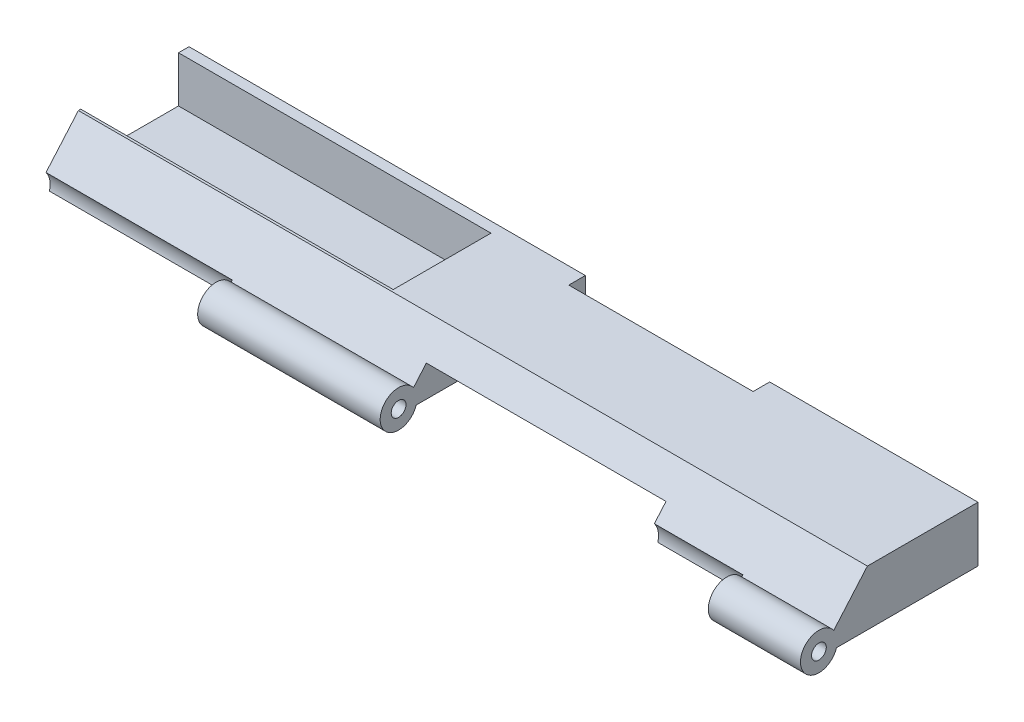
ISO-10303-21;
HEADER;
FILE_DESCRIPTION(('STEP AP214'),'2;1');
FILE_NAME('part.step','',(''),(''),'','','');
FILE_SCHEMA(('AUTOMOTIVE_DESIGN { 1 0 10303 214 1 1 1 1 }'));
ENDSEC;
DATA;
#1=APPLICATION_CONTEXT('core data for automotive mechanical design processes');
#2=APPLICATION_PROTOCOL_DEFINITION('international standard','automotive_design',2000,#1);
#3=PRODUCT_CONTEXT('',#1,'mechanical');
#4=PRODUCT('Part','Part','',(#3));
#5=PRODUCT_RELATED_PRODUCT_CATEGORY('part','',(#4));
#6=PRODUCT_DEFINITION_FORMATION('','',#4);
#7=PRODUCT_DEFINITION_CONTEXT('part definition',#1,'design');
#8=PRODUCT_DEFINITION('design','',#6,#7);
#9=PRODUCT_DEFINITION_SHAPE('','',#8);
#10=(LENGTH_UNIT() NAMED_UNIT(*) SI_UNIT(.MILLI.,.METRE.));
#11=(NAMED_UNIT(*) PLANE_ANGLE_UNIT() SI_UNIT($,.RADIAN.));
#12=(NAMED_UNIT(*) SI_UNIT($,.STERADIAN.) SOLID_ANGLE_UNIT());
#13=UNCERTAINTY_MEASURE_WITH_UNIT(LENGTH_MEASURE(1.E-05),#10,'distance_accuracy_value','');
#14=(GEOMETRIC_REPRESENTATION_CONTEXT(3) GLOBAL_UNCERTAINTY_ASSIGNED_CONTEXT((#13)) GLOBAL_UNIT_ASSIGNED_CONTEXT((#10,
#11,#12)) REPRESENTATION_CONTEXT('',''));
#15=CARTESIAN_POINT('',(0.,0.,0.));
#16=DIRECTION('',(0.,0.,1.));
#17=DIRECTION('',(1.,0.,0.));
#18=AXIS2_PLACEMENT_3D('',#15,#16,#17);
#19=CARTESIAN_POINT('',(-33.0281449270308,49.1077410265045,79.435537181548));
#20=DIRECTION('',(0.,-1.,0.));
#21=DIRECTION('',(1.,0.,0.));
#22=AXIS2_PLACEMENT_3D('',#19,#20,#21);
#23=PLANE('',#22);
#24=DIRECTION('',(0.,0.,1.));
#25=VECTOR('',#24,1.);
#26=CARTESIAN_POINT('',(3.67485507296902,49.1077410265045,79.435537181548));
#27=LINE('',#26,#25);
#28=CARTESIAN_POINT('',(3.67485507296901,49.1077410265045,65.973537181548));
#29=VERTEX_POINT('',#28);
#30=CARTESIAN_POINT('',(3.67485507296901,49.1077410265045,79.435537181548));
#31=VERTEX_POINT('',#30);
#32=EDGE_CURVE('E57',#29,#31,#27,.T.);
#33=ORIENTED_EDGE('',*,*,#32,.F.);
#34=DIRECTION('',(-1.,0.,0.));
#35=VECTOR('',#34,1.);
#36=CARTESIAN_POINT('',(-2.37034492703082,49.1077410265045,65.973537181548));
#37=LINE('',#36,#35);
#38=CARTESIAN_POINT('',(-33.0281449270308,49.1077410265045,65.973537181548));
#39=VERTEX_POINT('',#38);
#40=EDGE_CURVE('E196',#29,#39,#37,.T.);
#41=ORIENTED_EDGE('',*,*,#40,.T.);
#42=DIRECTION('',(0.,0.,-1.));
#43=VECTOR('',#42,1.);
#44=CARTESIAN_POINT('',(-33.0281449270308,49.1077410265045,79.435537181548));
#45=LINE('',#44,#43);
#46=CARTESIAN_POINT('',(-33.0281449270308,49.1077410265045,79.435537181548));
#47=VERTEX_POINT('',#46);
#48=EDGE_CURVE('E307',#47,#39,#45,.T.);
#49=ORIENTED_EDGE('',*,*,#48,.F.);
#50=DIRECTION('',(-1.,0.,0.));
#51=VECTOR('',#50,1.);
#52=CARTESIAN_POINT('',(-33.0281449270308,49.1077410265045,79.435537181548));
#53=LINE('',#52,#51);
#54=EDGE_CURVE('E303',#31,#47,#53,.T.);
#55=ORIENTED_EDGE('',*,*,#54,.F.);
#56=EDGE_LOOP('',(#33,#41,#49,#55));
#57=FACE_BOUND('',#56,.T.);
#58=ADVANCED_FACE('F34',(#57),#23,.F.);
#59=CARTESIAN_POINT('',(-33.0281449270308,50.4743412774687,79.435537181548));
#60=DIRECTION('',(0.,0.,-1.));
#61=DIRECTION('',(-1.,0.,0.));
#62=AXIS2_PLACEMENT_3D('',#59,#60,#61);
#63=PLANE('',#62);
#64=DIRECTION('',(1.,0.,0.));
#65=VECTOR('',#64,1.);
#66=CARTESIAN_POINT('',(-33.0281449270308,55.4577410265045,79.435537181548));
#67=LINE('',#66,#65);
#68=CARTESIAN_POINT('',(-33.0281449270308,55.4577410265045,79.435537181548));
#69=VERTEX_POINT('',#68);
#70=CARTESIAN_POINT('',(10.0248550729692,55.4577410265045,79.435537181548));
#71=VERTEX_POINT('',#70);
#72=EDGE_CURVE('E195',#69,#71,#67,.T.);
#73=ORIENTED_EDGE('',*,*,#72,.T.);
#74=DIRECTION('',(-0.707106781186556,-0.707106781186539,0.));
#75=VECTOR('',#74,1.);
#76=CARTESIAN_POINT('',(-13.9933448015493,31.4395411519867,79.435537181548));
#77=LINE('',#76,#75);
#78=EDGE_CURVE('E50',#71,#31,#77,.T.);
#79=ORIENTED_EDGE('',*,*,#78,.T.);
#80=ORIENTED_EDGE('',*,*,#54,.T.);
#81=DIRECTION('',(0.,1.,0.));
#82=VECTOR('',#81,1.);
#83=CARTESIAN_POINT('',(-33.0281449270308,55.4577410265045,79.435537181548));
#84=LINE('',#83,#82);
#85=EDGE_CURVE('E305',#47,#69,#84,.T.);
#86=ORIENTED_EDGE('',*,*,#85,.T.);
#87=EDGE_LOOP('',(#73,#79,#80,#86));
#88=FACE_BOUND('',#87,.T.);
#89=ADVANCED_FACE('F412',(#88),#63,.T.);
#90=CARTESIAN_POINT('',(-2.37034492703082,55.4577410265045,65.973537181548));
#91=DIRECTION('',(0.,0.,1.));
#92=DIRECTION('',(1.,0.,0.));
#93=AXIS2_PLACEMENT_3D('',#90,#91,#92);
#94=PLANE('',#93);
#95=ORIENTED_EDGE('',*,*,#40,.F.);
#96=DIRECTION('',(0.707106781186556,0.707106781186539,0.));
#97=VECTOR('',#96,1.);
#98=CARTESIAN_POINT('',(3.82725507296902,49.2601410265045,65.973537181548));
#99=LINE('',#98,#97);
#100=CARTESIAN_POINT('',(10.0248550729692,55.4577410265045,65.973537181548));
#101=VERTEX_POINT('',#100);
#102=EDGE_CURVE('E199',#29,#101,#99,.T.);
#103=ORIENTED_EDGE('',*,*,#102,.T.);
#104=DIRECTION('',(-1.,0.,0.));
#105=VECTOR('',#104,1.);
#106=CARTESIAN_POINT('',(-2.37034492703082,55.4577410265045,65.973537181548));
#107=LINE('',#106,#105);
#108=CARTESIAN_POINT('',(-33.0281449270308,55.4577410265045,65.973537181548));
#109=VERTEX_POINT('',#108);
#110=EDGE_CURVE('E184',#101,#109,#107,.T.);
#111=ORIENTED_EDGE('',*,*,#110,.T.);
#112=DIRECTION('',(0.,1.,0.));
#113=VECTOR('',#112,1.);
#114=CARTESIAN_POINT('',(-33.0281449270308,55.4577410265045,65.973537181548));
#115=LINE('',#114,#113);
#116=EDGE_CURVE('E298',#39,#109,#115,.T.);
#117=ORIENTED_EDGE('',*,*,#116,.F.);
#118=EDGE_LOOP('',(#95,#103,#111,#117));
#119=FACE_BOUND('',#118,.T.);
#120=ADVANCED_FACE('F200',(#119),#94,.T.);
#121=CARTESIAN_POINT('',(72.5088550729692,48.5997410265045,86.445937181548));
#122=DIRECTION('',(-1.,0.,0.));
#123=DIRECTION('',(0.,0.,1.));
#124=AXIS2_PLACEMENT_3D('',#121,#122,#123);
#125=CYLINDRICAL_SURFACE('',#124,2.794);
#126=CARTESIAN_POINT('',(62.9838550729692,48.5997410265045,86.445937181548));
#127=DIRECTION('',(1.,0.,0.));
#128=DIRECTION('',(0.,0.,-1.));
#129=AXIS2_PLACEMENT_3D('',#126,#127,#128);
#130=CIRCLE('',#129,2.794);
#131=CARTESIAN_POINT('',(62.9838550729692,50.2990084245781,84.2280719219246));
#132=VERTEX_POINT('',#131);
#133=CARTESIAN_POINT('',(62.9838550729692,47.8377410265045,83.7578538495064));
#134=VERTEX_POINT('',#133);
#135=EDGE_CURVE('E11',#132,#134,#130,.F.);
#136=ORIENTED_EDGE('',*,*,#135,.F.);
#137=DIRECTION('',(-1.,0.,0.));
#138=VECTOR('',#137,1.);
#139=CARTESIAN_POINT('',(72.5088550729692,50.2990084245781,84.2280719219246));
#140=LINE('',#139,#138);
#141=CARTESIAN_POINT('',(50.7918550729692,50.2990084245781,84.2280719219246));
#142=VERTEX_POINT('',#141);
#143=EDGE_CURVE('E283',#142,#132,#140,.F.);
#144=ORIENTED_EDGE('',*,*,#143,.F.);
#145=CARTESIAN_POINT('',(50.7918550729692,48.5997410265045,86.445937181548));
#146=DIRECTION('',(-1.,0.,0.));
#147=DIRECTION('',(0.,0.,1.));
#148=AXIS2_PLACEMENT_3D('',#145,#146,#147);
#149=CIRCLE('',#148,2.794);
#150=CARTESIAN_POINT('',(50.7918550729692,47.8377410265045,83.7578538495064));
#151=VERTEX_POINT('',#150);
#152=EDGE_CURVE('E217',#151,#142,#149,.F.);
#153=ORIENTED_EDGE('',*,*,#152,.F.);
#154=DIRECTION('',(-1.,0.,0.));
#155=VECTOR('',#154,1.);
#156=CARTESIAN_POINT('',(72.5088550729692,47.8377410265045,83.7578538495064));
#157=LINE('',#156,#155);
#158=EDGE_CURVE('E281',#134,#151,#157,.T.);
#159=ORIENTED_EDGE('',*,*,#158,.F.);
#160=EDGE_LOOP('',(#136,#144,#153,#159));
#161=FACE_BOUND('',#160,.T.);
#162=ADVANCED_FACE('F587',(#161),#125,.F.);
#163=CARTESIAN_POINT('',(129.531855072969,44.4241671474557,89.3098449751183));
#164=DIRECTION('',(0.,-0.654213003625094,-0.756310350245078));
#165=DIRECTION('',(0.,0.756310350245078,-0.654213003625094));
#166=AXIS2_PLACEMENT_3D('',#163,#164,#165);
#167=PLANE('',#166);
#168=DIRECTION('',(0.,-0.756310350245078,0.654213003625095));
#169=VECTOR('',#168,1.);
#170=CARTESIAN_POINT('',(-33.0281449270308,44.4241671474557,89.3098449751183));
#171=LINE('',#170,#169);
#172=CARTESIAN_POINT('',(-33.0281449270308,55.4577410265045,79.765737181548));
#173=VERTEX_POINT('',#172);
#174=CARTESIAN_POINT('',(-33.0281449270308,50.2990084245781,84.2280719219246));
#175=VERTEX_POINT('',#174);
#176=EDGE_CURVE('E360',#173,#175,#171,.T.);
#177=ORIENTED_EDGE('',*,*,#176,.T.);
#178=DIRECTION('',(-1.,0.,0.));
#179=VECTOR('',#178,1.);
#180=CARTESIAN_POINT('',(5.19885507296917,50.2990084245781,84.2280719219246));
#181=LINE('',#180,#179);
#182=CARTESIAN_POINT('',(-7.37414492703083,50.2990084245781,84.2280719219246));
#183=VERTEX_POINT('',#182);
#184=EDGE_CURVE('E310',#175,#183,#181,.F.);
#185=ORIENTED_EDGE('',*,*,#184,.T.);
#186=DIRECTION('',(0.,0.756310350245078,-0.654213003625094));
#187=VECTOR('',#186,1.);
#188=CARTESIAN_POINT('',(-7.37414492703083,63.2027515141516,73.0662565085815));
#189=LINE('',#188,#187);
#190=CARTESIAN_POINT('',(-7.37414492703083,50.1024214144257,84.3981208685558));
#191=VERTEX_POINT('',#190);
#192=EDGE_CURVE('E245',#191,#183,#189,.T.);
#193=ORIENTED_EDGE('',*,*,#192,.F.);
#194=DIRECTION('',(-1.,0.,0.));
#195=VECTOR('',#194,1.);
#196=CARTESIAN_POINT('',(-7.88214492703082,50.1024214144257,84.3981208685558));
#197=LINE('',#196,#195);
#198=CARTESIAN_POINT('',(17.7718550729691,50.1024214144257,84.3981208685558));
#199=VERTEX_POINT('',#198);
#200=EDGE_CURVE('E335',#191,#199,#197,.F.);
#201=ORIENTED_EDGE('',*,*,#200,.T.);
#202=DIRECTION('',(0.,0.756310350245078,-0.654213003625094));
#203=VECTOR('',#202,1.);
#204=CARTESIAN_POINT('',(17.7718550729692,44.4241671474557,89.3098449751183));
#205=LINE('',#204,#203);
#206=CARTESIAN_POINT('',(17.7718550729692,52.1557410265045,82.6219870494363));
#207=VERTEX_POINT('',#206);
#208=EDGE_CURVE('E350',#199,#207,#205,.T.);
#209=ORIENTED_EDGE('',*,*,#208,.T.);
#210=DIRECTION('',(1.,0.,0.));
#211=VECTOR('',#210,1.);
#212=CARTESIAN_POINT('',(129.531855072969,52.1557410265045,82.6219870494363));
#213=LINE('',#212,#211);
#214=CARTESIAN_POINT('',(50.7918550729692,52.1557410265045,82.6219870494363));
#215=VERTEX_POINT('',#214);
#216=EDGE_CURVE('E332',#207,#215,#213,.T.);
#217=ORIENTED_EDGE('',*,*,#216,.T.);
#218=DIRECTION('',(0.,0.756310350245078,-0.654213003625094));
#219=VECTOR('',#218,1.);
#220=CARTESIAN_POINT('',(50.7918550729692,63.2027515141517,73.0662565085814));
#221=LINE('',#220,#219);
#222=EDGE_CURVE('E220',#142,#215,#221,.T.);
#223=ORIENTED_EDGE('',*,*,#222,.F.);
#224=ORIENTED_EDGE('',*,*,#143,.T.);
#225=DIRECTION('',(0.,-0.756310350245078,0.654213003625095));
#226=VECTOR('',#225,1.);
#227=CARTESIAN_POINT('',(62.9838550729692,63.2027515141517,73.0662565085814));
#228=LINE('',#227,#226);
#229=CARTESIAN_POINT('',(62.9838550729692,50.1024214144257,84.3981208685558));
#230=VERTEX_POINT('',#229);
#231=EDGE_CURVE('E254',#132,#230,#228,.T.);
#232=ORIENTED_EDGE('',*,*,#231,.T.);
#233=DIRECTION('',(1.,0.,0.));
#234=VECTOR('',#233,1.);
#235=CARTESIAN_POINT('',(85.3358550729692,50.1024214144257,84.3981208685558));
#236=LINE('',#235,#234);
#237=CARTESIAN_POINT('',(75.6838550729692,50.1024214144257,84.3981208685558));
#238=VERTEX_POINT('',#237);
#239=EDGE_CURVE('E289',#230,#238,#236,.T.);
#240=ORIENTED_EDGE('',*,*,#239,.T.);
#241=DIRECTION('',(0.,-0.756310350245078,0.654213003625094));
#242=VECTOR('',#241,1.);
#243=CARTESIAN_POINT('',(75.6838550729692,44.4241671474557,89.3098449751183));
#244=LINE('',#243,#242);
#245=CARTESIAN_POINT('',(75.6838550729692,55.4577410265045,79.765737181548));
#246=VERTEX_POINT('',#245);
#247=EDGE_CURVE('E269',#246,#238,#244,.T.);
#248=ORIENTED_EDGE('',*,*,#247,.F.);
#249=DIRECTION('',(-1.,0.,0.));
#250=VECTOR('',#249,1.);
#251=CARTESIAN_POINT('',(129.531855072969,55.4577410265045,79.765737181548));
#252=LINE('',#251,#250);
#253=EDGE_CURVE('E368',#246,#173,#252,.T.);
#254=ORIENTED_EDGE('',*,*,#253,.T.);
#255=EDGE_LOOP('',(#177,#185,#193,#201,#209,#217,#223,#224,#232,#240,#248,#254));
#256=FACE_BOUND('',#255,.T.);
#257=ADVANCED_FACE('F36',(#256),#167,.F.);
#258=CARTESIAN_POINT('',(129.531855072969,55.4577410265045,96.3042172819337));
#259=DIRECTION('',(0.,-1.,0.));
#260=DIRECTION('',(0.,0.,-1.));
#261=AXIS2_PLACEMENT_3D('',#258,#259,#260);
#262=PLANE('',#261);
#263=DIRECTION('',(-1.,0.,0.));
#264=VECTOR('',#263,1.);
#265=CARTESIAN_POINT('',(129.531855072969,55.4577410265045,64.525737181548));
#266=LINE('',#265,#264);
#267=CARTESIAN_POINT('',(21.5818550729692,55.4577410265045,64.525737181548));
#268=VERTEX_POINT('',#267);
#269=CARTESIAN_POINT('',(-33.0281449270308,55.4577410265045,64.525737181548));
#270=VERTEX_POINT('',#269);
#271=EDGE_CURVE('E370',#268,#270,#266,.T.);
#272=ORIENTED_EDGE('',*,*,#271,.T.);
#273=DIRECTION('',(0.,0.,-1.));
#274=VECTOR('',#273,1.);
#275=CARTESIAN_POINT('',(-33.0281449270308,55.4577410265045,64.525737181548));
#276=LINE('',#275,#274);
#277=EDGE_CURVE('E191',#109,#270,#276,.T.);
#278=ORIENTED_EDGE('',*,*,#277,.F.);
#279=ORIENTED_EDGE('',*,*,#110,.F.);
#280=DIRECTION('',(0.,0.,-1.));
#281=VECTOR('',#280,1.);
#282=CARTESIAN_POINT('',(10.0248550729692,55.4577410265045,65.973537181548));
#283=LINE('',#282,#281);
#284=EDGE_CURVE('E189',#71,#101,#283,.T.);
#285=ORIENTED_EDGE('',*,*,#284,.F.);
#286=ORIENTED_EDGE('',*,*,#72,.F.);
#287=DIRECTION('',(0.,0.,-1.));
#288=VECTOR('',#287,1.);
#289=CARTESIAN_POINT('',(-33.0281449270308,55.4577410265045,64.525737181548));
#290=LINE('',#289,#288);
#291=EDGE_CURVE('E357',#173,#69,#290,.T.);
#292=ORIENTED_EDGE('',*,*,#291,.F.);
#293=ORIENTED_EDGE('',*,*,#253,.F.);
#294=DIRECTION('',(0.,0.,1.));
#295=VECTOR('',#294,1.);
#296=CARTESIAN_POINT('',(75.6838550729692,55.4577410265045,96.3042172819337));
#297=LINE('',#296,#295);
#298=CARTESIAN_POINT('',(75.6838550729692,55.4577410265045,64.525737181548));
#299=VERTEX_POINT('',#298);
#300=EDGE_CURVE('E267',#299,#246,#297,.T.);
#301=ORIENTED_EDGE('',*,*,#300,.F.);
#302=DIRECTION('',(-1.,0.,0.));
#303=VECTOR('',#302,1.);
#304=CARTESIAN_POINT('',(110.481855072969,55.4577410265045,64.525737181548));
#305=LINE('',#304,#303);
#306=CARTESIAN_POINT('',(46.9818550729692,55.4577410265045,64.525737181548));
#307=VERTEX_POINT('',#306);
#308=EDGE_CURVE('E294',#299,#307,#305,.T.);
#309=ORIENTED_EDGE('',*,*,#308,.T.);
#310=DIRECTION('',(0.,0.,-1.));
#311=VECTOR('',#310,1.);
#312=CARTESIAN_POINT('',(46.9818550729692,55.4577410265045,66.811737181548));
#313=LINE('',#312,#311);
#314=CARTESIAN_POINT('',(46.9818550729692,55.4577410265045,66.811737181548));
#315=VERTEX_POINT('',#314);
#316=EDGE_CURVE('E224',#315,#307,#313,.T.);
#317=ORIENTED_EDGE('',*,*,#316,.F.);
#318=DIRECTION('',(-1.,0.,0.));
#319=VECTOR('',#318,1.);
#320=CARTESIAN_POINT('',(129.531855072969,55.4577410265045,66.811737181548));
#321=LINE('',#320,#319);
#322=CARTESIAN_POINT('',(21.5818550729692,55.4577410265045,66.811737181548));
#323=VERTEX_POINT('',#322);
#324=EDGE_CURVE('E343',#315,#323,#321,.T.);
#325=ORIENTED_EDGE('',*,*,#324,.T.);
#326=DIRECTION('',(0.,0.,-1.));
#327=VECTOR('',#326,1.);
#328=CARTESIAN_POINT('',(21.5818550729692,55.4577410265045,96.3042172819337));
#329=LINE('',#328,#327);
#330=EDGE_CURVE('E347',#323,#268,#329,.T.);
#331=ORIENTED_EDGE('',*,*,#330,.T.);
#332=EDGE_LOOP('',(#272,#278,#279,#285,#286,#292,#293,#301,#309,#317,#325,#331));
#333=FACE_BOUND('',#332,.T.);
#334=ADVANCED_FACE('F186',(#333),#262,.F.);
#335=CARTESIAN_POINT('',(110.481855072969,48.5997410265045,86.445937181548));
#336=DIRECTION('',(-1.,0.,0.));
#337=DIRECTION('',(0.,0.,1.));
#338=AXIS2_PLACEMENT_3D('',#335,#336,#337);
#339=CYLINDRICAL_SURFACE('',#338,1.016);
#340=CARTESIAN_POINT('',(75.6838550729692,48.5997410265045,86.445937181548));
#341=DIRECTION('',(1.,0.,0.));
#342=DIRECTION('',(0.,0.,-1.));
#343=AXIS2_PLACEMENT_3D('',#340,#341,#342);
#344=CIRCLE('',#343,1.016);
#345=CARTESIAN_POINT('',(75.6838550729692,48.5997410265045,85.429937181548));
#346=VERTEX_POINT('',#345);
#347=EDGE_CURVE('E278',#346,#346,#344,.F.);
#348=ORIENTED_EDGE('',*,*,#347,.F.);
#349=EDGE_LOOP('',(#348));
#350=FACE_BOUND('',#349,.T.);
#351=CARTESIAN_POINT('',(62.9838550729692,48.5997410265045,86.445937181548));
#352=DIRECTION('',(1.,0.,0.));
#353=DIRECTION('',(0.,0.,-1.));
#354=AXIS2_PLACEMENT_3D('',#351,#352,#353);
#355=CIRCLE('',#354,1.016);
#356=CARTESIAN_POINT('',(62.9838550729692,48.5997410265045,85.429937181548));
#357=VERTEX_POINT('',#356);
#358=EDGE_CURVE('E263',#357,#357,#355,.F.);
#359=ORIENTED_EDGE('',*,*,#358,.T.);
#360=EDGE_LOOP('',(#359));
#361=FACE_BOUND('',#360,.T.);
#362=ADVANCED_FACE('F460',(#350,#361),#339,.F.);
#363=CARTESIAN_POINT('',(85.3358550729692,48.5997410265045,86.445937181548));
#364=DIRECTION('',(1.,0.,0.));
#365=DIRECTION('',(0.,0.,-1.));
#366=AXIS2_PLACEMENT_3D('',#363,#364,#365);
#367=CYLINDRICAL_SURFACE('',#366,2.54);
#368=DIRECTION('',(1.,0.,0.));
#369=VECTOR('',#368,1.);
#370=CARTESIAN_POINT('',(85.3358550729692,47.8377410265045,84.022931609949));
#371=LINE('',#370,#369);
#372=CARTESIAN_POINT('',(75.6838550729692,47.8377410265045,84.022931609949));
#373=VERTEX_POINT('',#372);
#374=CARTESIAN_POINT('',(62.9838550729692,47.8377410265045,84.022931609949));
#375=VERTEX_POINT('',#374);
#376=EDGE_CURVE('E292',#373,#375,#371,.F.);
#377=ORIENTED_EDGE('',*,*,#376,.F.);
#378=CARTESIAN_POINT('',(75.6838550729692,48.5997410265045,86.445937181548));
#379=DIRECTION('',(1.,0.,0.));
#380=DIRECTION('',(0.,0.,-1.));
#381=AXIS2_PLACEMENT_3D('',#378,#379,#380);
#382=CIRCLE('',#381,2.54);
#383=EDGE_CURVE('E270',#373,#238,#382,.F.);
#384=ORIENTED_EDGE('',*,*,#383,.T.);
#385=ORIENTED_EDGE('',*,*,#239,.F.);
#386=CARTESIAN_POINT('',(62.9838550729692,48.5997410265045,86.445937181548));
#387=DIRECTION('',(1.,0.,0.));
#388=DIRECTION('',(0.,0.,-1.));
#389=AXIS2_PLACEMENT_3D('',#386,#387,#388);
#390=CIRCLE('',#389,2.54);
#391=EDGE_CURVE('E257',#230,#375,#390,.T.);
#392=ORIENTED_EDGE('',*,*,#391,.T.);
#393=EDGE_LOOP('',(#377,#384,#385,#392));
#394=FACE_BOUND('',#393,.T.);
#395=ADVANCED_FACE('F609',(#394),#367,.T.);
#396=CARTESIAN_POINT('',(110.481855072969,47.8377410265045,96.3042172819337));
#397=DIRECTION('',(0.,1.,0.));
#398=DIRECTION('',(0.,0.,1.));
#399=AXIS2_PLACEMENT_3D('',#396,#397,#398);
#400=PLANE('',#399);
#401=DIRECTION('',(-1.,0.,0.));
#402=VECTOR('',#401,1.);
#403=CARTESIAN_POINT('',(110.481855072969,47.8377410265045,64.525737181548));
#404=LINE('',#403,#402);
#405=CARTESIAN_POINT('',(75.6838550729692,47.8377410265045,64.525737181548));
#406=VERTEX_POINT('',#405);
#407=CARTESIAN_POINT('',(50.7918550729692,47.8377410265045,64.525737181548));
#408=VERTEX_POINT('',#407);
#409=EDGE_CURVE('E296',#406,#408,#404,.T.);
#410=ORIENTED_EDGE('',*,*,#409,.F.);
#411=DIRECTION('',(0.,0.,-1.));
#412=VECTOR('',#411,1.);
#413=CARTESIAN_POINT('',(75.6838550729692,47.8377410265045,96.3042172819337));
#414=LINE('',#413,#412);
#415=EDGE_CURVE('E273',#373,#406,#414,.T.);
#416=ORIENTED_EDGE('',*,*,#415,.F.);
#417=ORIENTED_EDGE('',*,*,#376,.T.);
#418=DIRECTION('',(0.,0.,-1.));
#419=VECTOR('',#418,1.);
#420=CARTESIAN_POINT('',(62.9838550729692,47.8377410265045,0.));
#421=LINE('',#420,#419);
#422=EDGE_CURVE('E260',#375,#134,#421,.T.);
#423=ORIENTED_EDGE('',*,*,#422,.T.);
#424=ORIENTED_EDGE('',*,*,#158,.T.);
#425=DIRECTION('',(0.,0.,1.));
#426=VECTOR('',#425,1.);
#427=CARTESIAN_POINT('',(50.7918550729692,47.8377410265045,0.));
#428=LINE('',#427,#426);
#429=EDGE_CURVE('E214',#408,#151,#428,.T.);
#430=ORIENTED_EDGE('',*,*,#429,.F.);
#431=EDGE_LOOP('',(#410,#416,#417,#423,#424,#430));
#432=FACE_BOUND('',#431,.T.);
#433=ADVANCED_FACE('F616',(#432),#400,.F.);
#434=CARTESIAN_POINT('',(110.481855072969,50.4743412774687,64.525737181548));
#435=DIRECTION('',(0.,0.,1.));
#436=DIRECTION('',(1.,0.,0.));
#437=AXIS2_PLACEMENT_3D('',#434,#435,#436);
#438=PLANE('',#437);
#439=DIRECTION('',(0.,1.,0.));
#440=VECTOR('',#439,1.);
#441=CARTESIAN_POINT('',(75.6838550729692,50.4743412774687,64.525737181548));
#442=LINE('',#441,#440);
#443=EDGE_CURVE('E266',#406,#299,#442,.T.);
#444=ORIENTED_EDGE('',*,*,#443,.F.);
#445=ORIENTED_EDGE('',*,*,#409,.T.);
#446=DIRECTION('',(0.,-1.,0.));
#447=VECTOR('',#446,1.);
#448=CARTESIAN_POINT('',(50.7918550729692,0.,64.525737181548));
#449=LINE('',#448,#447);
#450=CARTESIAN_POINT('',(50.7918550729692,52.1557410265045,64.525737181548));
#451=VERTEX_POINT('',#450);
#452=EDGE_CURVE('E211',#451,#408,#449,.T.);
#453=ORIENTED_EDGE('',*,*,#452,.F.);
#454=DIRECTION('',(1.,0.,0.));
#455=VECTOR('',#454,1.);
#456=CARTESIAN_POINT('',(59.6818550729692,52.1557410265045,64.525737181548));
#457=LINE('',#456,#455);
#458=CARTESIAN_POINT('',(46.9818550729692,52.1557410265045,64.525737181548));
#459=VERTEX_POINT('',#458);
#460=EDGE_CURVE('E286',#459,#451,#457,.T.);
#461=ORIENTED_EDGE('',*,*,#460,.F.);
#462=DIRECTION('',(0.,-1.,0.));
#463=VECTOR('',#462,1.);
#464=CARTESIAN_POINT('',(46.9818550729692,55.4577410265045,64.525737181548));
#465=LINE('',#464,#463);
#466=EDGE_CURVE('E227',#307,#459,#465,.T.);
#467=ORIENTED_EDGE('',*,*,#466,.F.);
#468=ORIENTED_EDGE('',*,*,#308,.F.);
#469=EDGE_LOOP('',(#444,#445,#453,#461,#467,#468));
#470=FACE_BOUND('',#469,.T.);
#471=ADVANCED_FACE('F443',(#470),#438,.F.);
#472=CARTESIAN_POINT('',(-33.0281449270308,52.1557410265045,96.3042172819337));
#473=DIRECTION('',(0.,1.,0.));
#474=DIRECTION('',(0.,0.,1.));
#475=AXIS2_PLACEMENT_3D('',#472,#473,#474);
#476=PLANE('',#475);
#477=ORIENTED_EDGE('',*,*,#460,.T.);
#478=DIRECTION('',(0.,0.,-1.));
#479=VECTOR('',#478,1.);
#480=CARTESIAN_POINT('',(50.7918550729692,52.1557410265045,0.));
#481=LINE('',#480,#479);
#482=EDGE_CURVE('E222',#215,#451,#481,.T.);
#483=ORIENTED_EDGE('',*,*,#482,.F.);
#484=ORIENTED_EDGE('',*,*,#216,.F.);
#485=DIRECTION('',(0.,0.,-1.));
#486=VECTOR('',#485,1.);
#487=CARTESIAN_POINT('',(17.7718550729692,52.1557410265045,64.525737181548));
#488=LINE('',#487,#486);
#489=CARTESIAN_POINT('',(17.7718550729692,52.1557410265045,64.525737181548));
#490=VERTEX_POINT('',#489);
#491=EDGE_CURVE('E326',#207,#490,#488,.T.);
#492=ORIENTED_EDGE('',*,*,#491,.T.);
#493=DIRECTION('',(1.,0.,0.));
#494=VECTOR('',#493,1.);
#495=CARTESIAN_POINT('',(78.7318550729692,52.1557410265045,64.525737181548));
#496=LINE('',#495,#494);
#497=CARTESIAN_POINT('',(21.5818550729692,52.1557410265045,64.525737181548));
#498=VERTEX_POINT('',#497);
#499=EDGE_CURVE('E324',#490,#498,#496,.T.);
#500=ORIENTED_EDGE('',*,*,#499,.T.);
#501=DIRECTION('',(0.,0.,-1.));
#502=VECTOR('',#501,1.);
#503=CARTESIAN_POINT('',(21.5818550729692,52.1557410265045,96.3042172819337));
#504=LINE('',#503,#502);
#505=CARTESIAN_POINT('',(21.5818550729692,52.1557410265045,66.811737181548));
#506=VERTEX_POINT('',#505);
#507=EDGE_CURVE('E329',#506,#498,#504,.T.);
#508=ORIENTED_EDGE('',*,*,#507,.F.);
#509=DIRECTION('',(-1.,0.,0.));
#510=VECTOR('',#509,1.);
#511=CARTESIAN_POINT('',(-33.0281449270308,52.1557410265045,66.811737181548));
#512=LINE('',#511,#510);
#513=CARTESIAN_POINT('',(46.9818550729692,52.1557410265045,66.811737181548));
#514=VERTEX_POINT('',#513);
#515=EDGE_CURVE('E375',#514,#506,#512,.T.);
#516=ORIENTED_EDGE('',*,*,#515,.F.);
#517=DIRECTION('',(0.,0.,1.));
#518=VECTOR('',#517,1.);
#519=CARTESIAN_POINT('',(46.9818550729692,52.1557410265045,64.525737181548));
#520=LINE('',#519,#518);
#521=EDGE_CURVE('E230',#459,#514,#520,.T.);
#522=ORIENTED_EDGE('',*,*,#521,.F.);
#523=EDGE_LOOP('',(#477,#483,#484,#492,#500,#508,#516,#522));
#524=FACE_BOUND('',#523,.T.);
#525=ADVANCED_FACE('F440',(#524),#476,.F.);
#526=CARTESIAN_POINT('',(-33.0281449270308,66.1257410265045,66.811737181548));
#527=DIRECTION('',(0.,0.,1.));
#528=DIRECTION('',(1.,0.,0.));
#529=AXIS2_PLACEMENT_3D('',#526,#527,#528);
#530=PLANE('',#529);
#531=ORIENTED_EDGE('',*,*,#324,.F.);
#532=DIRECTION('',(0.,1.,0.));
#533=VECTOR('',#532,1.);
#534=CARTESIAN_POINT('',(46.9818550729692,52.1557410265045,66.811737181548));
#535=LINE('',#534,#533);
#536=EDGE_CURVE('E233',#514,#315,#535,.T.);
#537=ORIENTED_EDGE('',*,*,#536,.F.);
#538=ORIENTED_EDGE('',*,*,#515,.T.);
#539=DIRECTION('',(0.,-1.,0.));
#540=VECTOR('',#539,1.);
#541=CARTESIAN_POINT('',(21.5818550729692,66.1257410265045,66.811737181548));
#542=LINE('',#541,#540);
#543=EDGE_CURVE('E339',#323,#506,#542,.T.);
#544=ORIENTED_EDGE('',*,*,#543,.F.);
#545=EDGE_LOOP('',(#531,#537,#538,#544));
#546=FACE_BOUND('',#545,.T.);
#547=ADVANCED_FACE('F425',(#546),#530,.F.);
#548=CARTESIAN_POINT('',(5.19885507296917,48.5997410265045,86.445937181548));
#549=DIRECTION('',(-1.,0.,0.));
#550=DIRECTION('',(0.,0.,1.));
#551=AXIS2_PLACEMENT_3D('',#548,#549,#550);
#552=CYLINDRICAL_SURFACE('',#551,2.794);
#553=CARTESIAN_POINT('',(-33.0281449270308,48.5997410265045,86.445937181548));
#554=DIRECTION('',(-1.,0.,0.));
#555=DIRECTION('',(0.,0.,1.));
#556=AXIS2_PLACEMENT_3D('',#553,#554,#555);
#557=CIRCLE('',#556,2.79400000000001);
#558=CARTESIAN_POINT('',(-33.0281449270308,47.8377410265045,83.7578538495064));
#559=VERTEX_POINT('',#558);
#560=EDGE_CURVE('E236',#175,#559,#557,.T.);
#561=ORIENTED_EDGE('',*,*,#560,.T.);
#562=DIRECTION('',(-1.,0.,0.));
#563=VECTOR('',#562,1.);
#564=CARTESIAN_POINT('',(5.19885507296917,47.8377410265045,83.7578538495064));
#565=LINE('',#564,#563);
#566=CARTESIAN_POINT('',(-7.37414492703084,47.8377410265045,83.7578538495064));
#567=VERTEX_POINT('',#566);
#568=EDGE_CURVE('E43',#567,#559,#565,.T.);
#569=ORIENTED_EDGE('',*,*,#568,.F.);
#570=CARTESIAN_POINT('',(-7.37414492703083,48.5997410265045,86.445937181548));
#571=DIRECTION('',(-1.,0.,0.));
#572=DIRECTION('',(0.,0.,1.));
#573=AXIS2_PLACEMENT_3D('',#570,#571,#572);
#574=CIRCLE('',#573,2.794);
#575=EDGE_CURVE('E251',#567,#183,#574,.F.);
#576=ORIENTED_EDGE('',*,*,#575,.T.);
#577=ORIENTED_EDGE('',*,*,#184,.F.);
#578=EDGE_LOOP('',(#561,#569,#576,#577));
#579=FACE_BOUND('',#578,.T.);
#580=ADVANCED_FACE('F385',(#579),#552,.F.);
#581=CARTESIAN_POINT('',(129.531855072969,47.8377410265045,96.3042172819337));
#582=DIRECTION('',(0.,1.,0.));
#583=DIRECTION('',(0.,0.,1.));
#584=AXIS2_PLACEMENT_3D('',#581,#582,#583);
#585=PLANE('',#584);
#586=ORIENTED_EDGE('',*,*,#568,.T.);
#587=DIRECTION('',(0.,0.,-1.));
#588=VECTOR('',#587,1.);
#589=CARTESIAN_POINT('',(-33.0281449270308,47.8377410265045,96.3042172819337));
#590=LINE('',#589,#588);
#591=CARTESIAN_POINT('',(-33.0281449270308,47.8377410265045,64.525737181548));
#592=VERTEX_POINT('',#591);
#593=EDGE_CURVE('E363',#559,#592,#590,.T.);
#594=ORIENTED_EDGE('',*,*,#593,.T.);
#595=DIRECTION('',(-1.,0.,0.));
#596=VECTOR('',#595,1.);
#597=CARTESIAN_POINT('',(129.531855072969,47.8377410265045,64.525737181548));
#598=LINE('',#597,#596);
#599=CARTESIAN_POINT('',(17.7718550729692,47.8377410265045,64.525737181548));
#600=VERTEX_POINT('',#599);
#601=EDGE_CURVE('E372',#600,#592,#598,.T.);
#602=ORIENTED_EDGE('',*,*,#601,.F.);
#603=DIRECTION('',(0.,0.,-1.));
#604=VECTOR('',#603,1.);
#605=CARTESIAN_POINT('',(17.7718550729692,47.8377410265045,82.305737181548));
#606=LINE('',#605,#604);
#607=CARTESIAN_POINT('',(17.7718550729691,47.8377410265045,84.022931609949));
#608=VERTEX_POINT('',#607);
#609=EDGE_CURVE('E355',#608,#600,#606,.T.);
#610=ORIENTED_EDGE('',*,*,#609,.F.);
#611=DIRECTION('',(-1.,0.,0.));
#612=VECTOR('',#611,1.);
#613=CARTESIAN_POINT('',(-7.88214492703082,47.8377410265045,84.022931609949));
#614=LINE('',#613,#612);
#615=CARTESIAN_POINT('',(-7.37414492703083,47.8377410265045,84.022931609949));
#616=VERTEX_POINT('',#615);
#617=EDGE_CURVE('E337',#608,#616,#614,.T.);
#618=ORIENTED_EDGE('',*,*,#617,.T.);
#619=DIRECTION('',(0.,0.,1.));
#620=VECTOR('',#619,1.);
#621=CARTESIAN_POINT('',(-7.37414492703083,47.8377410265045,0.));
#622=LINE('',#621,#620);
#623=EDGE_CURVE('E248',#567,#616,#622,.T.);
#624=ORIENTED_EDGE('',*,*,#623,.F.);
#625=EDGE_LOOP('',(#586,#594,#602,#610,#618,#624));
#626=FACE_BOUND('',#625,.T.);
#627=ADVANCED_FACE('F379',(#626),#585,.F.);
#628=CARTESIAN_POINT('',(-7.88214492703082,48.5997410265045,86.445937181548));
#629=DIRECTION('',(-1.,0.,0.));
#630=DIRECTION('',(0.,0.,1.));
#631=AXIS2_PLACEMENT_3D('',#628,#629,#630);
#632=CYLINDRICAL_SURFACE('',#631,2.54);
#633=ORIENTED_EDGE('',*,*,#200,.F.);
#634=CARTESIAN_POINT('',(-7.37414492703083,48.5997410265045,86.445937181548));
#635=DIRECTION('',(-1.,0.,0.));
#636=DIRECTION('',(0.,0.,1.));
#637=AXIS2_PLACEMENT_3D('',#634,#635,#636);
#638=CIRCLE('',#637,2.54);
#639=EDGE_CURVE('E242',#616,#191,#638,.T.);
#640=ORIENTED_EDGE('',*,*,#639,.F.);
#641=ORIENTED_EDGE('',*,*,#617,.F.);
#642=CARTESIAN_POINT('',(17.7718550729691,48.5997410265045,86.445937181548));
#643=DIRECTION('',(1.,0.,0.));
#644=DIRECTION('',(0.,0.,-1.));
#645=AXIS2_PLACEMENT_3D('',#642,#643,#644);
#646=CIRCLE('',#645,2.54);
#647=EDGE_CURVE('E312',#199,#608,#646,.T.);
#648=ORIENTED_EDGE('',*,*,#647,.F.);
#649=EDGE_LOOP('',(#633,#640,#641,#648));
#650=FACE_BOUND('',#649,.T.);
#651=ADVANCED_FACE('F402',(#650),#632,.T.);
#652=CARTESIAN_POINT('',(129.531855072969,48.5997410265045,86.445937181548));
#653=DIRECTION('',(-1.,0.,0.));
#654=DIRECTION('',(0.,0.,1.));
#655=AXIS2_PLACEMENT_3D('',#652,#653,#654);
#656=CYLINDRICAL_SURFACE('',#655,1.016);
#657=CARTESIAN_POINT('',(17.7718550729691,48.5997410265045,86.445937181548));
#658=DIRECTION('',(1.,0.,0.));
#659=DIRECTION('',(0.,0.,-1.));
#660=AXIS2_PLACEMENT_3D('',#657,#658,#659);
#661=CIRCLE('',#660,1.016);
#662=CARTESIAN_POINT('',(17.7718550729691,48.5997410265045,85.429937181548));
#663=VERTEX_POINT('',#662);
#664=EDGE_CURVE('E315',#663,#663,#661,.F.);
#665=ORIENTED_EDGE('',*,*,#664,.F.);
#666=EDGE_LOOP('',(#665));
#667=FACE_BOUND('',#666,.T.);
#668=CARTESIAN_POINT('',(-7.37414492703083,48.5997410265045,86.445937181548));
#669=DIRECTION('',(-1.,0.,0.));
#670=DIRECTION('',(0.,0.,1.));
#671=AXIS2_PLACEMENT_3D('',#668,#669,#670);
#672=CIRCLE('',#671,1.016);
#673=CARTESIAN_POINT('',(-7.37414492703083,48.5997410265045,87.461937181548));
#674=VERTEX_POINT('',#673);
#675=EDGE_CURVE('E239',#674,#674,#672,.T.);
#676=ORIENTED_EDGE('',*,*,#675,.T.);
#677=EDGE_LOOP('',(#676));
#678=FACE_BOUND('',#677,.T.);
#679=ADVANCED_FACE('F426',(#667,#678),#656,.F.);
#680=CARTESIAN_POINT('',(129.531855072969,50.4743412774687,64.525737181548));
#681=DIRECTION('',(0.,0.,1.));
#682=DIRECTION('',(1.,0.,0.));
#683=AXIS2_PLACEMENT_3D('',#680,#681,#682);
#684=PLANE('',#683);
#685=DIRECTION('',(0.,1.,0.));
#686=VECTOR('',#685,1.);
#687=CARTESIAN_POINT('',(-33.0281449270308,50.4743412774687,64.525737181548));
#688=LINE('',#687,#686);
#689=EDGE_CURVE('E365',#592,#270,#688,.T.);
#690=ORIENTED_EDGE('',*,*,#689,.T.);
#691=ORIENTED_EDGE('',*,*,#271,.F.);
#692=DIRECTION('',(0.,-1.,0.));
#693=VECTOR('',#692,1.);
#694=CARTESIAN_POINT('',(21.5818550729692,66.1257410265045,64.525737181548));
#695=LINE('',#694,#693);
#696=EDGE_CURVE('E340',#268,#498,#695,.T.);
#697=ORIENTED_EDGE('',*,*,#696,.T.);
#698=ORIENTED_EDGE('',*,*,#499,.F.);
#699=DIRECTION('',(0.,-1.,0.));
#700=VECTOR('',#699,1.);
#701=CARTESIAN_POINT('',(17.7718550729692,50.8857410265045,64.525737181548));
#702=LINE('',#701,#700);
#703=EDGE_CURVE('E352',#490,#600,#702,.T.);
#704=ORIENTED_EDGE('',*,*,#703,.T.);
#705=ORIENTED_EDGE('',*,*,#601,.T.);
#706=EDGE_LOOP('',(#690,#691,#697,#698,#704,#705));
#707=FACE_BOUND('',#706,.T.);
#708=ADVANCED_FACE('F392',(#707),#684,.F.);
#709=CARTESIAN_POINT('',(-33.0281449270308,50.4743412774687,96.3042172819337));
#710=DIRECTION('',(1.,0.,0.));
#711=DIRECTION('',(0.,0.,-1.));
#712=AXIS2_PLACEMENT_3D('',#709,#710,#711);
#713=PLANE('',#712);
#714=ORIENTED_EDGE('',*,*,#593,.F.);
#715=ORIENTED_EDGE('',*,*,#560,.F.);
#716=ORIENTED_EDGE('',*,*,#176,.F.);
#717=ORIENTED_EDGE('',*,*,#291,.T.);
#718=ORIENTED_EDGE('',*,*,#85,.F.);
#719=ORIENTED_EDGE('',*,*,#48,.T.);
#720=ORIENTED_EDGE('',*,*,#116,.T.);
#721=ORIENTED_EDGE('',*,*,#277,.T.);
#722=ORIENTED_EDGE('',*,*,#689,.F.);
#723=EDGE_LOOP('',(#714,#715,#716,#717,#718,#719,#720,#721,#722));
#724=FACE_BOUND('',#723,.T.);
#725=ADVANCED_FACE('F389',(#724),#713,.F.);
#726=CARTESIAN_POINT('',(17.7718550729692,50.8857410265045,82.305737181548));
#727=DIRECTION('',(-1.,0.,0.));
#728=DIRECTION('',(0.,0.,1.));
#729=AXIS2_PLACEMENT_3D('',#726,#727,#728);
#730=PLANE('',#729);
#731=CARTESIAN_POINT('',(17.7718550729692,49.9967410265045,67.065737181548));
#732=DIRECTION('',(-1.,0.,0.));
#733=DIRECTION('',(0.,0.,1.));
#734=AXIS2_PLACEMENT_3D('',#731,#732,#733);
#735=CIRCLE('',#734,1.016);
#736=CARTESIAN_POINT('',(17.7718550729692,49.9967410265045,68.081737181548));
#737=VERTEX_POINT('',#736);
#738=EDGE_CURVE('E321',#737,#737,#735,.F.);
#739=ORIENTED_EDGE('',*,*,#738,.F.);
#740=EDGE_LOOP('',(#739));
#741=FACE_BOUND('',#740,.T.);
#742=ORIENTED_EDGE('',*,*,#491,.F.);
#743=ORIENTED_EDGE('',*,*,#208,.F.);
#744=ORIENTED_EDGE('',*,*,#647,.T.);
#745=ORIENTED_EDGE('',*,*,#609,.T.);
#746=ORIENTED_EDGE('',*,*,#703,.F.);
#747=EDGE_LOOP('',(#742,#743,#744,#745,#746));
#748=FACE_BOUND('',#747,.T.);
#749=ORIENTED_EDGE('',*,*,#664,.T.);
#750=EDGE_LOOP('',(#749));
#751=FACE_BOUND('',#750,.T.);
#752=ADVANCED_FACE('F399',(#741,#748,#751),#730,.F.);
#753=CARTESIAN_POINT('',(21.5818550729692,66.1257410265045,96.3042172819337));
#754=DIRECTION('',(-1.,0.,0.));
#755=DIRECTION('',(0.,0.,1.));
#756=AXIS2_PLACEMENT_3D('',#753,#754,#755);
#757=PLANE('',#756);
#758=ORIENTED_EDGE('',*,*,#543,.T.);
#759=ORIENTED_EDGE('',*,*,#507,.T.);
#760=ORIENTED_EDGE('',*,*,#696,.F.);
#761=ORIENTED_EDGE('',*,*,#330,.F.);
#762=EDGE_LOOP('',(#758,#759,#760,#761));
#763=FACE_BOUND('',#762,.T.);
#764=ADVANCED_FACE('F438',(#763),#757,.F.);
#765=CARTESIAN_POINT('',(83.8118550729692,49.9967410265045,67.065737181548));
#766=DIRECTION('',(-1.,0.,0.));
#767=DIRECTION('',(0.,0.,1.));
#768=AXIS2_PLACEMENT_3D('',#765,#766,#767);
#769=CYLINDRICAL_SURFACE('',#768,1.016);
#770=CARTESIAN_POINT('',(12.6918550729692,49.9967410265045,67.065737181548));
#771=DIRECTION('',(1.,0.,0.));
#772=DIRECTION('',(0.,0.,-1.));
#773=AXIS2_PLACEMENT_3D('',#770,#771,#772);
#774=CIRCLE('',#773,1.016);
#775=CARTESIAN_POINT('',(12.6918550729692,49.9967410265045,66.049737181548));
#776=VERTEX_POINT('',#775);
#777=EDGE_CURVE('E318',#776,#776,#774,.T.);
#778=ORIENTED_EDGE('',*,*,#777,.F.);
#779=EDGE_LOOP('',(#778));
#780=FACE_BOUND('',#779,.T.);
#781=ORIENTED_EDGE('',*,*,#738,.T.);
#782=EDGE_LOOP('',(#781));
#783=FACE_BOUND('',#782,.T.);
#784=ADVANCED_FACE('F434',(#780,#783),#769,.F.);
#785=CARTESIAN_POINT('',(12.6918550729692,50.4743412774687,96.3042172819337));
#786=DIRECTION('',(1.,0.,0.));
#787=DIRECTION('',(0.,0.,-1.));
#788=AXIS2_PLACEMENT_3D('',#785,#786,#787);
#789=PLANE('',#788);
#790=ORIENTED_EDGE('',*,*,#777,.T.);
#791=EDGE_LOOP('',(#790));
#792=FACE_BOUND('',#791,.T.);
#793=ADVANCED_FACE('F430',(#792),#789,.T.);
#794=CARTESIAN_POINT('',(75.6838550729692,68.1577410265045,0.));
#795=DIRECTION('',(1.,0.,0.));
#796=DIRECTION('',(0.,0.,-1.));
#797=AXIS2_PLACEMENT_3D('',#794,#795,#796);
#798=PLANE('',#797);
#799=ORIENTED_EDGE('',*,*,#247,.T.);
#800=ORIENTED_EDGE('',*,*,#383,.F.);
#801=ORIENTED_EDGE('',*,*,#415,.T.);
#802=ORIENTED_EDGE('',*,*,#443,.T.);
#803=ORIENTED_EDGE('',*,*,#300,.T.);
#804=EDGE_LOOP('',(#799,#800,#801,#802,#803));
#805=FACE_BOUND('',#804,.T.);
#806=ORIENTED_EDGE('',*,*,#347,.T.);
#807=EDGE_LOOP('',(#806));
#808=FACE_BOUND('',#807,.T.);
#809=ADVANCED_FACE('F433',(#805,#808),#798,.T.);
#810=CARTESIAN_POINT('',(62.9838550729692,0.,0.));
#811=DIRECTION('',(1.,0.,0.));
#812=DIRECTION('',(0.,0.,-1.));
#813=AXIS2_PLACEMENT_3D('',#810,#811,#812);
#814=PLANE('',#813);
#815=ORIENTED_EDGE('',*,*,#358,.F.);
#816=EDGE_LOOP('',(#815));
#817=FACE_BOUND('',#816,.T.);
#818=ORIENTED_EDGE('',*,*,#231,.F.);
#819=ORIENTED_EDGE('',*,*,#135,.T.);
#820=ORIENTED_EDGE('',*,*,#422,.F.);
#821=ORIENTED_EDGE('',*,*,#391,.F.);
#822=EDGE_LOOP('',(#818,#819,#820,#821));
#823=FACE_BOUND('',#822,.T.);
#824=ADVANCED_FACE('F517',(#817,#823),#814,.F.);
#825=CARTESIAN_POINT('',(-7.37414492703083,0.,0.));
#826=DIRECTION('',(-1.,0.,0.));
#827=DIRECTION('',(0.,0.,1.));
#828=AXIS2_PLACEMENT_3D('',#825,#826,#827);
#829=PLANE('',#828);
#830=ORIENTED_EDGE('',*,*,#675,.F.);
#831=EDGE_LOOP('',(#830));
#832=FACE_BOUND('',#831,.T.);
#833=ORIENTED_EDGE('',*,*,#575,.F.);
#834=ORIENTED_EDGE('',*,*,#623,.T.);
#835=ORIENTED_EDGE('',*,*,#639,.T.);
#836=ORIENTED_EDGE('',*,*,#192,.T.);
#837=EDGE_LOOP('',(#833,#834,#835,#836));
#838=FACE_BOUND('',#837,.T.);
#839=ADVANCED_FACE('F406',(#832,#838),#829,.T.);
#840=CARTESIAN_POINT('',(46.9818550729692,0.,0.));
#841=DIRECTION('',(-1.,0.,0.));
#842=DIRECTION('',(0.,0.,1.));
#843=AXIS2_PLACEMENT_3D('',#840,#841,#842);
#844=PLANE('',#843);
#845=ORIENTED_EDGE('',*,*,#316,.T.);
#846=ORIENTED_EDGE('',*,*,#466,.T.);
#847=ORIENTED_EDGE('',*,*,#521,.T.);
#848=ORIENTED_EDGE('',*,*,#536,.T.);
#849=EDGE_LOOP('',(#845,#846,#847,#848));
#850=FACE_BOUND('',#849,.T.);
#851=ADVANCED_FACE('F531',(#850),#844,.T.);
#852=CARTESIAN_POINT('',(50.7918550729692,0.,0.));
#853=DIRECTION('',(-1.,0.,0.));
#854=DIRECTION('',(0.,0.,1.));
#855=AXIS2_PLACEMENT_3D('',#852,#853,#854);
#856=PLANE('',#855);
#857=CARTESIAN_POINT('',(50.7918550729692,49.9967410265045,67.065737181548));
#858=DIRECTION('',(-1.,0.,0.));
#859=DIRECTION('',(0.,0.,1.));
#860=AXIS2_PLACEMENT_3D('',#857,#858,#859);
#861=CIRCLE('',#860,1.016);
#862=CARTESIAN_POINT('',(50.7918550729692,49.9967410265045,68.081737181548));
#863=VERTEX_POINT('',#862);
#864=EDGE_CURVE('E38',#863,#863,#861,.F.);
#865=ORIENTED_EDGE('',*,*,#864,.T.);
#866=EDGE_LOOP('',(#865));
#867=FACE_BOUND('',#866,.T.);
#868=ORIENTED_EDGE('',*,*,#452,.T.);
#869=ORIENTED_EDGE('',*,*,#429,.T.);
#870=ORIENTED_EDGE('',*,*,#152,.T.);
#871=ORIENTED_EDGE('',*,*,#222,.T.);
#872=ORIENTED_EDGE('',*,*,#482,.T.);
#873=EDGE_LOOP('',(#868,#869,#870,#871,#872));
#874=FACE_BOUND('',#873,.T.);
#875=ADVANCED_FACE('F539',(#867,#874),#856,.T.);
#876=CARTESIAN_POINT('',(55.8718550729692,49.9967410265045,67.065737181548));
#877=DIRECTION('',(-1.,0.,0.));
#878=DIRECTION('',(0.,0.,1.));
#879=AXIS2_PLACEMENT_3D('',#876,#877,#878);
#880=CYLINDRICAL_SURFACE('',#879,1.016);
#881=ORIENTED_EDGE('',*,*,#864,.F.);
#882=EDGE_LOOP('',(#881));
#883=FACE_BOUND('',#882,.T.);
#884=CARTESIAN_POINT('',(55.8718550729692,49.9967410265045,67.065737181548));
#885=DIRECTION('',(1.,0.,0.));
#886=DIRECTION('',(0.,0.,-1.));
#887=AXIS2_PLACEMENT_3D('',#884,#885,#886);
#888=CIRCLE('',#887,1.016);
#889=CARTESIAN_POINT('',(55.8718550729692,49.9967410265045,66.049737181548));
#890=VERTEX_POINT('',#889);
#891=EDGE_CURVE('E204',#890,#890,#888,.T.);
#892=ORIENTED_EDGE('',*,*,#891,.T.);
#893=EDGE_LOOP('',(#892));
#894=FACE_BOUND('',#893,.T.);
#895=ADVANCED_FACE('F548',(#883,#894),#880,.F.);
#896=CARTESIAN_POINT('',(55.8718550729692,49.9967410265045,67.065737181548));
#897=DIRECTION('',(1.,0.,0.));
#898=DIRECTION('',(0.,0.,-1.));
#899=AXIS2_PLACEMENT_3D('',#896,#897,#898);
#900=PLANE('',#899);
#901=ORIENTED_EDGE('',*,*,#891,.F.);
#902=EDGE_LOOP('',(#901));
#903=FACE_BOUND('',#902,.T.);
#904=ADVANCED_FACE('F556',(#903),#900,.F.);
#905=CARTESIAN_POINT('',(-22.7164429767678,22.7164429767683,79.638737181548));
#906=DIRECTION('',(0.707106781186539,-0.707106781186556,0.));
#907=DIRECTION('',(0.707106781186556,0.707106781186539,0.));
#908=AXIS2_PLACEMENT_3D('',#905,#906,#907);
#909=PLANE('',#908);
#910=ORIENTED_EDGE('',*,*,#78,.F.);
#911=ORIENTED_EDGE('',*,*,#284,.T.);
#912=ORIENTED_EDGE('',*,*,#102,.F.);
#913=ORIENTED_EDGE('',*,*,#32,.T.);
#914=EDGE_LOOP('',(#910,#911,#912,#913));
#915=FACE_BOUND('',#914,.T.);
#916=ADVANCED_FACE('F203',(#915),#909,.F.);
#917=CLOSED_SHELL('',(#58,#89,#120,#162,#257,#334,#362,#395,#433,#471,#525,#547,#580,#627,#651,
#679,#708,#725,#752,#764,#784,#793,#809,#824,#839,#851,#875,#895,#904,#916));
#918=MANIFOLD_SOLID_BREP('B2',#917);
#919=ADVANCED_BREP_SHAPE_REPRESENTATION('',(#18,#918),#14);
#920=SHAPE_DEFINITION_REPRESENTATION(#9,#919);
ENDSEC;
END-ISO-10303-21;
